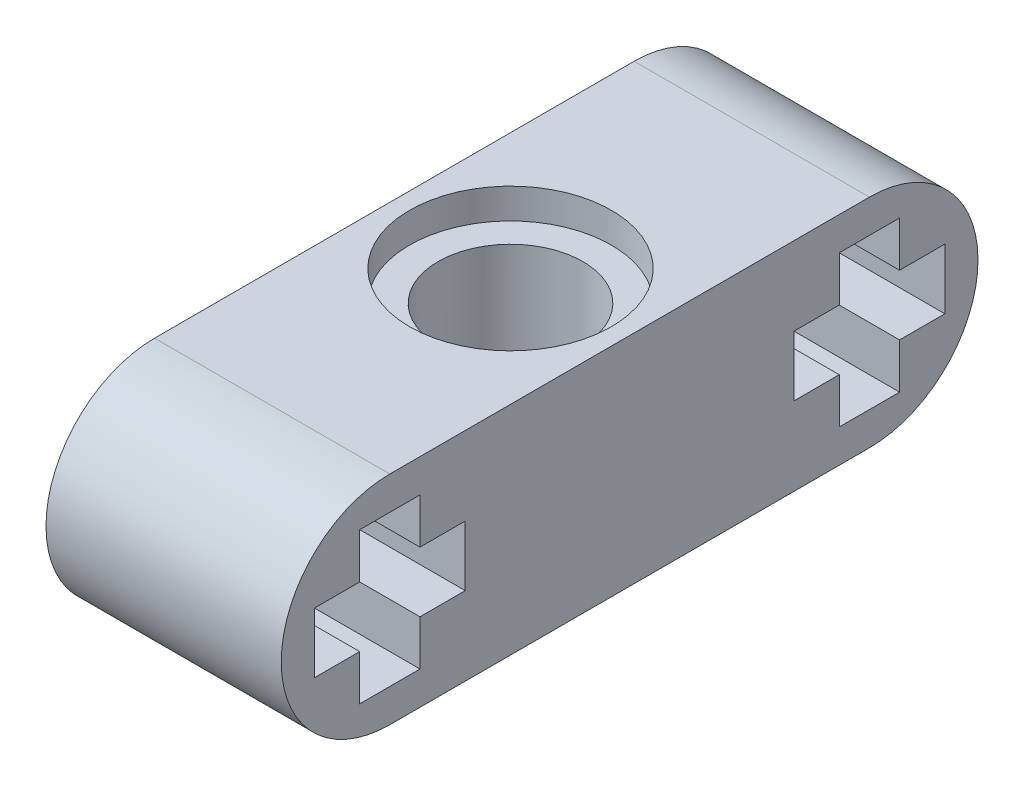
ISO-10303-21;
HEADER;
FILE_DESCRIPTION(('STEP AP214'),'2;1');
FILE_NAME('part.step','',(''),(''),'','','');
FILE_SCHEMA(('AUTOMOTIVE_DESIGN { 1 0 10303 214 1 1 1 1 }'));
ENDSEC;
DATA;
#1=APPLICATION_CONTEXT('core data for automotive mechanical design processes');
#2=APPLICATION_PROTOCOL_DEFINITION('international standard','automotive_design',2000,#1);
#3=PRODUCT_CONTEXT('',#1,'mechanical');
#4=PRODUCT('Part','Part','',(#3));
#5=PRODUCT_RELATED_PRODUCT_CATEGORY('part','',(#4));
#6=PRODUCT_DEFINITION_FORMATION('','',#4);
#7=PRODUCT_DEFINITION_CONTEXT('part definition',#1,'design');
#8=PRODUCT_DEFINITION('design','',#6,#7);
#9=PRODUCT_DEFINITION_SHAPE('','',#8);
#10=(LENGTH_UNIT() NAMED_UNIT(*) SI_UNIT(.MILLI.,.METRE.));
#11=(NAMED_UNIT(*) PLANE_ANGLE_UNIT() SI_UNIT($,.RADIAN.));
#12=(NAMED_UNIT(*) SI_UNIT($,.STERADIAN.) SOLID_ANGLE_UNIT());
#13=UNCERTAINTY_MEASURE_WITH_UNIT(LENGTH_MEASURE(1.E-05),#10,'distance_accuracy_value','');
#14=(GEOMETRIC_REPRESENTATION_CONTEXT(3) GLOBAL_UNCERTAINTY_ASSIGNED_CONTEXT((#13)) GLOBAL_UNIT_ASSIGNED_CONTEXT((#10,
#11,#12)) REPRESENTATION_CONTEXT('',''));
#15=CARTESIAN_POINT('',(0.,0.,0.));
#16=DIRECTION('',(0.,0.,1.));
#17=DIRECTION('',(1.,0.,0.));
#18=AXIS2_PLACEMENT_3D('',#15,#16,#17);
#19=CARTESIAN_POINT('',(3.90000000000001,-3.6,8.00000000000018));
#20=DIRECTION('',(0.,1.,0.));
#21=DIRECTION('',(0.,0.,1.));
#22=AXIS2_PLACEMENT_3D('',#19,#20,#21);
#23=CYLINDRICAL_SURFACE('',#22,2.4);
#24=CARTESIAN_POINT('',(3.90000000000001,2.6,8.00000000000018));
#25=DIRECTION('',(0.,1.,0.));
#26=DIRECTION('',(0.,0.,1.));
#27=AXIS2_PLACEMENT_3D('',#24,#25,#26);
#28=CIRCLE('',#27,2.4);
#29=CARTESIAN_POINT('',(3.90000000000001,2.6,10.4000000000002));
#30=VERTEX_POINT('',#29);
#31=EDGE_CURVE('E278',#30,#30,#28,.F.);
#32=ORIENTED_EDGE('',*,*,#31,.F.);
#33=EDGE_LOOP('',(#32));
#34=FACE_BOUND('',#33,.T.);
#35=CARTESIAN_POINT('',(3.90000000000001,-2.6,8.00000000000018));
#36=DIRECTION('',(0.,-1.,0.));
#37=DIRECTION('',(0.,0.,-1.));
#38=AXIS2_PLACEMENT_3D('',#35,#36,#37);
#39=CIRCLE('',#38,2.4);
#40=CARTESIAN_POINT('',(3.90000000000001,-2.6,5.60000000000018));
#41=VERTEX_POINT('',#40);
#42=EDGE_CURVE('E49',#41,#41,#39,.F.);
#43=ORIENTED_EDGE('',*,*,#42,.F.);
#44=EDGE_LOOP('',(#43));
#45=FACE_BOUND('',#44,.T.);
#46=ADVANCED_FACE('F45',(#34,#45),#23,.F.);
#47=CARTESIAN_POINT('',(7.8,0.,0.));
#48=DIRECTION('',(1.,0.,0.));
#49=DIRECTION('',(0.,0.,-1.));
#50=AXIS2_PLACEMENT_3D('',#47,#48,#49);
#51=PLANE('',#50);
#52=CARTESIAN_POINT('',(7.8,0.,0.));
#53=DIRECTION('',(1.,0.,0.));
#54=DIRECTION('',(0.,0.,-1.));
#55=AXIS2_PLACEMENT_3D('',#52,#53,#54);
#56=CIRCLE('',#55,3.6);
#57=CARTESIAN_POINT('',(7.8,-3.6,0.));
#58=VERTEX_POINT('',#57);
#59=CARTESIAN_POINT('',(7.8,3.6,0.));
#60=VERTEX_POINT('',#59);
#61=EDGE_CURVE('E415',#58,#60,#56,.T.);
#62=ORIENTED_EDGE('',*,*,#61,.T.);
#63=DIRECTION('',(0.,0.,1.));
#64=VECTOR('',#63,1.);
#65=CARTESIAN_POINT('',(7.8,3.6,0.));
#66=LINE('',#65,#64);
#67=CARTESIAN_POINT('',(7.8,3.6,15.8999999999966));
#68=VERTEX_POINT('',#67);
#69=EDGE_CURVE('E418',#60,#68,#66,.T.);
#70=ORIENTED_EDGE('',*,*,#69,.T.);
#71=CARTESIAN_POINT('',(7.8,0.,15.8999999999966));
#72=DIRECTION('',(1.,0.,0.));
#73=DIRECTION('',(0.,0.,-1.));
#74=AXIS2_PLACEMENT_3D('',#71,#72,#73);
#75=CIRCLE('',#74,3.6);
#76=CARTESIAN_POINT('',(7.8,-3.6,15.8999999999966));
#77=VERTEX_POINT('',#76);
#78=EDGE_CURVE('E421',#68,#77,#75,.T.);
#79=ORIENTED_EDGE('',*,*,#78,.T.);
#80=DIRECTION('',(0.,0.,-1.));
#81=VECTOR('',#80,1.);
#82=CARTESIAN_POINT('',(7.8,-3.6,0.));
#83=LINE('',#82,#81);
#84=EDGE_CURVE('E423',#77,#58,#83,.T.);
#85=ORIENTED_EDGE('',*,*,#84,.T.);
#86=EDGE_LOOP('',(#62,#70,#79,#85));
#87=FACE_BOUND('',#86,.T.);
#88=DIRECTION('',(0.,1.,0.));
#89=VECTOR('',#88,1.);
#90=CARTESIAN_POINT('',(7.8,1.,-1.));
#91=LINE('',#90,#89);
#92=CARTESIAN_POINT('',(7.8,1.,-1.));
#93=VERTEX_POINT('',#92);
#94=CARTESIAN_POINT('',(7.8,2.5,-1.));
#95=VERTEX_POINT('',#94);
#96=EDGE_CURVE('E330',#93,#95,#91,.T.);
#97=ORIENTED_EDGE('',*,*,#96,.F.);
#98=DIRECTION('',(0.,0.,1.));
#99=VECTOR('',#98,1.);
#100=CARTESIAN_POINT('',(7.8,1.,-1.));
#101=LINE('',#100,#99);
#102=CARTESIAN_POINT('',(7.8,1.,-2.5));
#103=VERTEX_POINT('',#102);
#104=EDGE_CURVE('E328',#103,#93,#101,.T.);
#105=ORIENTED_EDGE('',*,*,#104,.F.);
#106=DIRECTION('',(0.,1.,0.));
#107=VECTOR('',#106,1.);
#108=CARTESIAN_POINT('',(7.8,-1.,-2.5));
#109=LINE('',#108,#107);
#110=CARTESIAN_POINT('',(7.8,-1.,-2.5));
#111=VERTEX_POINT('',#110);
#112=EDGE_CURVE('E352',#111,#103,#109,.T.);
#113=ORIENTED_EDGE('',*,*,#112,.F.);
#114=DIRECTION('',(0.,0.,-1.));
#115=VECTOR('',#114,1.);
#116=CARTESIAN_POINT('',(7.8,-1.,-1.));
#117=LINE('',#116,#115);
#118=CARTESIAN_POINT('',(7.8,-1.,-1.));
#119=VERTEX_POINT('',#118);
#120=EDGE_CURVE('E349',#119,#111,#117,.T.);
#121=ORIENTED_EDGE('',*,*,#120,.F.);
#122=DIRECTION('',(0.,1.,0.));
#123=VECTOR('',#122,1.);
#124=CARTESIAN_POINT('',(7.8,-2.5,-1.));
#125=LINE('',#124,#123);
#126=CARTESIAN_POINT('',(7.8,-2.5,-1.));
#127=VERTEX_POINT('',#126);
#128=EDGE_CURVE('E347',#127,#119,#125,.T.);
#129=ORIENTED_EDGE('',*,*,#128,.F.);
#130=DIRECTION('',(0.,0.,-1.));
#131=VECTOR('',#130,1.);
#132=CARTESIAN_POINT('',(7.8,-2.5,-1.));
#133=LINE('',#132,#131);
#134=CARTESIAN_POINT('',(7.8,-2.5,1.));
#135=VERTEX_POINT('',#134);
#136=EDGE_CURVE('E345',#135,#127,#133,.T.);
#137=ORIENTED_EDGE('',*,*,#136,.F.);
#138=DIRECTION('',(0.,-1.,0.));
#139=VECTOR('',#138,1.);
#140=CARTESIAN_POINT('',(7.8,-2.5,1.));
#141=LINE('',#140,#139);
#142=CARTESIAN_POINT('',(7.8,-1.,1.));
#143=VERTEX_POINT('',#142);
#144=EDGE_CURVE('E343',#143,#135,#141,.T.);
#145=ORIENTED_EDGE('',*,*,#144,.F.);
#146=DIRECTION('',(0.,0.,-1.));
#147=VECTOR('',#146,1.);
#148=CARTESIAN_POINT('',(7.8,-1.,2.5));
#149=LINE('',#148,#147);
#150=CARTESIAN_POINT('',(7.8,-1.,2.5));
#151=VERTEX_POINT('',#150);
#152=EDGE_CURVE('E341',#151,#143,#149,.T.);
#153=ORIENTED_EDGE('',*,*,#152,.F.);
#154=DIRECTION('',(0.,-1.,0.));
#155=VECTOR('',#154,1.);
#156=CARTESIAN_POINT('',(7.8,-1.,2.5));
#157=LINE('',#156,#155);
#158=CARTESIAN_POINT('',(7.8,1.,2.5));
#159=VERTEX_POINT('',#158);
#160=EDGE_CURVE('E339',#159,#151,#157,.T.);
#161=ORIENTED_EDGE('',*,*,#160,.F.);
#162=DIRECTION('',(0.,0.,1.));
#163=VECTOR('',#162,1.);
#164=CARTESIAN_POINT('',(7.8,1.,2.5));
#165=LINE('',#164,#163);
#166=CARTESIAN_POINT('',(7.8,1.,1.));
#167=VERTEX_POINT('',#166);
#168=EDGE_CURVE('E337',#167,#159,#165,.T.);
#169=ORIENTED_EDGE('',*,*,#168,.F.);
#170=DIRECTION('',(0.,-1.,0.));
#171=VECTOR('',#170,1.);
#172=CARTESIAN_POINT('',(7.8,1.,1.));
#173=LINE('',#172,#171);
#174=CARTESIAN_POINT('',(7.8,2.5,1.));
#175=VERTEX_POINT('',#174);
#176=EDGE_CURVE('E335',#175,#167,#173,.T.);
#177=ORIENTED_EDGE('',*,*,#176,.F.);
#178=DIRECTION('',(0.,0.,1.));
#179=VECTOR('',#178,1.);
#180=CARTESIAN_POINT('',(7.8,2.5,-1.));
#181=LINE('',#180,#179);
#182=EDGE_CURVE('E333',#95,#175,#181,.T.);
#183=ORIENTED_EDGE('',*,*,#182,.F.);
#184=EDGE_LOOP('',(#97,#105,#113,#121,#129,#137,#145,#153,#161,#169,#177,#183));
#185=FACE_BOUND('',#184,.T.);
#186=DIRECTION('',(0.,1.,0.));
#187=VECTOR('',#186,1.);
#188=CARTESIAN_POINT('',(7.8,-1.,13.3999999999931));
#189=LINE('',#188,#187);
#190=CARTESIAN_POINT('',(7.8,-1.,13.3999999999931));
#191=VERTEX_POINT('',#190);
#192=CARTESIAN_POINT('',(7.8,1.,13.3999999999931));
#193=VERTEX_POINT('',#192);
#194=EDGE_CURVE('E240',#191,#193,#189,.T.);
#195=ORIENTED_EDGE('',*,*,#194,.F.);
#196=DIRECTION('',(0.,0.,-1.));
#197=VECTOR('',#196,1.);
#198=CARTESIAN_POINT('',(7.8,-1.,13.3999999999931));
#199=LINE('',#198,#197);
#200=CARTESIAN_POINT('',(7.8,-1.,14.8999999999931));
#201=VERTEX_POINT('',#200);
#202=EDGE_CURVE('E232',#201,#191,#199,.T.);
#203=ORIENTED_EDGE('',*,*,#202,.F.);
#204=DIRECTION('',(0.,1.,0.));
#205=VECTOR('',#204,1.);
#206=CARTESIAN_POINT('',(7.8,-2.5,14.8999999999931));
#207=LINE('',#206,#205);
#208=CARTESIAN_POINT('',(7.8,-2.5,14.8999999999931));
#209=VERTEX_POINT('',#208);
#210=EDGE_CURVE('E275',#209,#201,#207,.T.);
#211=ORIENTED_EDGE('',*,*,#210,.F.);
#212=DIRECTION('',(0.,0.,-1.));
#213=VECTOR('',#212,1.);
#214=CARTESIAN_POINT('',(7.8,-2.5,16.8999999999931));
#215=LINE('',#214,#213);
#216=CARTESIAN_POINT('',(7.8,-2.5,16.8999999999931));
#217=VERTEX_POINT('',#216);
#218=EDGE_CURVE('E273',#217,#209,#215,.T.);
#219=ORIENTED_EDGE('',*,*,#218,.F.);
#220=DIRECTION('',(0.,-1.,0.));
#221=VECTOR('',#220,1.);
#222=CARTESIAN_POINT('',(7.8,-2.5,16.8999999999931));
#223=LINE('',#222,#221);
#224=CARTESIAN_POINT('',(7.8,-1.,16.8999999999931));
#225=VERTEX_POINT('',#224);
#226=EDGE_CURVE('E271',#225,#217,#223,.T.);
#227=ORIENTED_EDGE('',*,*,#226,.F.);
#228=DIRECTION('',(0.,0.,-1.));
#229=VECTOR('',#228,1.);
#230=CARTESIAN_POINT('',(7.8,-1.,16.8999999999931));
#231=LINE('',#230,#229);
#232=CARTESIAN_POINT('',(7.8,-1.,18.3999999999931));
#233=VERTEX_POINT('',#232);
#234=EDGE_CURVE('E269',#233,#225,#231,.T.);
#235=ORIENTED_EDGE('',*,*,#234,.F.);
#236=DIRECTION('',(0.,-1.,0.));
#237=VECTOR('',#236,1.);
#238=CARTESIAN_POINT('',(7.8,-1.,18.3999999999931));
#239=LINE('',#238,#237);
#240=CARTESIAN_POINT('',(7.8,1.,18.3999999999931));
#241=VERTEX_POINT('',#240);
#242=EDGE_CURVE('E267',#241,#233,#239,.T.);
#243=ORIENTED_EDGE('',*,*,#242,.F.);
#244=DIRECTION('',(0.,0.,1.));
#245=VECTOR('',#244,1.);
#246=CARTESIAN_POINT('',(7.8,1.,16.8999999999931));
#247=LINE('',#246,#245);
#248=CARTESIAN_POINT('',(7.8,1.,16.8999999999931));
#249=VERTEX_POINT('',#248);
#250=EDGE_CURVE('E265',#249,#241,#247,.T.);
#251=ORIENTED_EDGE('',*,*,#250,.F.);
#252=DIRECTION('',(0.,-1.,0.));
#253=VECTOR('',#252,1.);
#254=CARTESIAN_POINT('',(7.8,1.,16.8999999999931));
#255=LINE('',#254,#253);
#256=CARTESIAN_POINT('',(7.8,2.5,16.8999999999931));
#257=VERTEX_POINT('',#256);
#258=EDGE_CURVE('E263',#257,#249,#255,.T.);
#259=ORIENTED_EDGE('',*,*,#258,.F.);
#260=DIRECTION('',(0.,0.,1.));
#261=VECTOR('',#260,1.);
#262=CARTESIAN_POINT('',(7.8,2.5,16.8999999999931));
#263=LINE('',#262,#261);
#264=CARTESIAN_POINT('',(7.8,2.5,14.8999999999931));
#265=VERTEX_POINT('',#264);
#266=EDGE_CURVE('E261',#265,#257,#263,.T.);
#267=ORIENTED_EDGE('',*,*,#266,.F.);
#268=DIRECTION('',(0.,1.,0.));
#269=VECTOR('',#268,1.);
#270=CARTESIAN_POINT('',(7.8,1.,14.8999999999931));
#271=LINE('',#270,#269);
#272=CARTESIAN_POINT('',(7.8,1.,14.8999999999931));
#273=VERTEX_POINT('',#272);
#274=EDGE_CURVE('E256',#273,#265,#271,.T.);
#275=ORIENTED_EDGE('',*,*,#274,.F.);
#276=DIRECTION('',(0.,0.,1.));
#277=VECTOR('',#276,1.);
#278=CARTESIAN_POINT('',(7.8,1.,13.3999999999931));
#279=LINE('',#278,#277);
#280=EDGE_CURVE('E254',#193,#273,#279,.T.);
#281=ORIENTED_EDGE('',*,*,#280,.F.);
#282=EDGE_LOOP('',(#195,#203,#211,#219,#227,#235,#243,#251,#259,#267,#275,#281));
#283=FACE_BOUND('',#282,.T.);
#284=ADVANCED_FACE('F252',(#87,#185,#283),#51,.T.);
#285=CARTESIAN_POINT('',(0.,0.,0.));
#286=DIRECTION('',(1.,0.,0.));
#287=DIRECTION('',(0.,0.,-1.));
#288=AXIS2_PLACEMENT_3D('',#285,#286,#287);
#289=PLANE('',#288);
#290=DIRECTION('',(0.,0.,1.));
#291=VECTOR('',#290,1.);
#292=CARTESIAN_POINT('',(0.,1.,-1.));
#293=LINE('',#292,#291);
#294=CARTESIAN_POINT('',(0.,1.,-2.5));
#295=VERTEX_POINT('',#294);
#296=CARTESIAN_POINT('',(0.,1.,-1.));
#297=VERTEX_POINT('',#296);
#298=EDGE_CURVE('E248',#295,#297,#293,.T.);
#299=ORIENTED_EDGE('',*,*,#298,.T.);
#300=DIRECTION('',(0.,1.,0.));
#301=VECTOR('',#300,1.);
#302=CARTESIAN_POINT('',(0.,1.,-1.));
#303=LINE('',#302,#301);
#304=CARTESIAN_POINT('',(0.,2.5,-1.));
#305=VERTEX_POINT('',#304);
#306=EDGE_CURVE('E357',#297,#305,#303,.T.);
#307=ORIENTED_EDGE('',*,*,#306,.T.);
#308=DIRECTION('',(0.,0.,1.));
#309=VECTOR('',#308,1.);
#310=CARTESIAN_POINT('',(0.,2.5,-1.));
#311=LINE('',#310,#309);
#312=CARTESIAN_POINT('',(0.,2.5,1.));
#313=VERTEX_POINT('',#312);
#314=EDGE_CURVE('E360',#305,#313,#311,.T.);
#315=ORIENTED_EDGE('',*,*,#314,.T.);
#316=DIRECTION('',(0.,-1.,0.));
#317=VECTOR('',#316,1.);
#318=CARTESIAN_POINT('',(0.,1.,1.));
#319=LINE('',#318,#317);
#320=CARTESIAN_POINT('',(0.,1.,1.));
#321=VERTEX_POINT('',#320);
#322=EDGE_CURVE('E363',#313,#321,#319,.T.);
#323=ORIENTED_EDGE('',*,*,#322,.T.);
#324=DIRECTION('',(0.,0.,1.));
#325=VECTOR('',#324,1.);
#326=CARTESIAN_POINT('',(0.,1.,2.5));
#327=LINE('',#326,#325);
#328=CARTESIAN_POINT('',(0.,1.,2.5));
#329=VERTEX_POINT('',#328);
#330=EDGE_CURVE('E366',#321,#329,#327,.T.);
#331=ORIENTED_EDGE('',*,*,#330,.T.);
#332=DIRECTION('',(0.,-1.,0.));
#333=VECTOR('',#332,1.);
#334=CARTESIAN_POINT('',(0.,-1.,2.5));
#335=LINE('',#334,#333);
#336=CARTESIAN_POINT('',(0.,-1.,2.5));
#337=VERTEX_POINT('',#336);
#338=EDGE_CURVE('E369',#329,#337,#335,.T.);
#339=ORIENTED_EDGE('',*,*,#338,.T.);
#340=DIRECTION('',(0.,0.,-1.));
#341=VECTOR('',#340,1.);
#342=CARTESIAN_POINT('',(0.,-1.,2.5));
#343=LINE('',#342,#341);
#344=CARTESIAN_POINT('',(0.,-1.,1.));
#345=VERTEX_POINT('',#344);
#346=EDGE_CURVE('E372',#337,#345,#343,.T.);
#347=ORIENTED_EDGE('',*,*,#346,.T.);
#348=DIRECTION('',(0.,-1.,0.));
#349=VECTOR('',#348,1.);
#350=CARTESIAN_POINT('',(0.,-2.5,1.));
#351=LINE('',#350,#349);
#352=CARTESIAN_POINT('',(0.,-2.5,1.));
#353=VERTEX_POINT('',#352);
#354=EDGE_CURVE('E375',#345,#353,#351,.T.);
#355=ORIENTED_EDGE('',*,*,#354,.T.);
#356=DIRECTION('',(0.,0.,-1.));
#357=VECTOR('',#356,1.);
#358=CARTESIAN_POINT('',(0.,-2.5,-1.));
#359=LINE('',#358,#357);
#360=CARTESIAN_POINT('',(0.,-2.5,-1.));
#361=VERTEX_POINT('',#360);
#362=EDGE_CURVE('E378',#353,#361,#359,.T.);
#363=ORIENTED_EDGE('',*,*,#362,.T.);
#364=DIRECTION('',(0.,1.,0.));
#365=VECTOR('',#364,1.);
#366=CARTESIAN_POINT('',(0.,-2.5,-1.));
#367=LINE('',#366,#365);
#368=CARTESIAN_POINT('',(0.,-1.,-1.));
#369=VERTEX_POINT('',#368);
#370=EDGE_CURVE('E381',#361,#369,#367,.T.);
#371=ORIENTED_EDGE('',*,*,#370,.T.);
#372=DIRECTION('',(0.,0.,-1.));
#373=VECTOR('',#372,1.);
#374=CARTESIAN_POINT('',(0.,-1.,-1.));
#375=LINE('',#374,#373);
#376=CARTESIAN_POINT('',(0.,-1.,-2.5));
#377=VERTEX_POINT('',#376);
#378=EDGE_CURVE('E384',#369,#377,#375,.T.);
#379=ORIENTED_EDGE('',*,*,#378,.T.);
#380=DIRECTION('',(0.,1.,0.));
#381=VECTOR('',#380,1.);
#382=CARTESIAN_POINT('',(0.,-1.,-2.5));
#383=LINE('',#382,#381);
#384=EDGE_CURVE('E331',#377,#295,#383,.T.);
#385=ORIENTED_EDGE('',*,*,#384,.T.);
#386=EDGE_LOOP('',(#299,#307,#315,#323,#331,#339,#347,#355,#363,#371,#379,#385));
#387=FACE_BOUND('',#386,.T.);
#388=CARTESIAN_POINT('',(0.,0.,0.));
#389=DIRECTION('',(1.,0.,0.));
#390=DIRECTION('',(0.,0.,-1.));
#391=AXIS2_PLACEMENT_3D('',#388,#389,#390);
#392=CIRCLE('',#391,3.6);
#393=CARTESIAN_POINT('',(0.,-3.6,0.));
#394=VERTEX_POINT('',#393);
#395=CARTESIAN_POINT('',(0.,3.6,0.));
#396=VERTEX_POINT('',#395);
#397=EDGE_CURVE('E414',#394,#396,#392,.T.);
#398=ORIENTED_EDGE('',*,*,#397,.F.);
#399=DIRECTION('',(0.,0.,-1.));
#400=VECTOR('',#399,1.);
#401=CARTESIAN_POINT('',(0.,-3.6,0.));
#402=LINE('',#401,#400);
#403=CARTESIAN_POINT('',(0.,-3.6,15.8999999999966));
#404=VERTEX_POINT('',#403);
#405=EDGE_CURVE('E419',#404,#394,#402,.T.);
#406=ORIENTED_EDGE('',*,*,#405,.F.);
#407=CARTESIAN_POINT('',(0.,0.,15.8999999999966));
#408=DIRECTION('',(1.,0.,0.));
#409=DIRECTION('',(0.,0.,-1.));
#410=AXIS2_PLACEMENT_3D('',#407,#408,#409);
#411=CIRCLE('',#410,3.6);
#412=CARTESIAN_POINT('',(0.,3.6,15.8999999999966));
#413=VERTEX_POINT('',#412);
#414=EDGE_CURVE('E430',#413,#404,#411,.T.);
#415=ORIENTED_EDGE('',*,*,#414,.F.);
#416=DIRECTION('',(0.,0.,1.));
#417=VECTOR('',#416,1.);
#418=CARTESIAN_POINT('',(0.,3.6,0.));
#419=LINE('',#418,#417);
#420=EDGE_CURVE('E428',#396,#413,#419,.T.);
#421=ORIENTED_EDGE('',*,*,#420,.F.);
#422=EDGE_LOOP('',(#398,#406,#415,#421));
#423=FACE_BOUND('',#422,.T.);
#424=DIRECTION('',(0.,0.,-1.));
#425=VECTOR('',#424,1.);
#426=CARTESIAN_POINT('',(0.,-1.,13.3999999999931));
#427=LINE('',#426,#425);
#428=CARTESIAN_POINT('',(0.,-1.,14.8999999999931));
#429=VERTEX_POINT('',#428);
#430=CARTESIAN_POINT('',(0.,-1.,13.3999999999931));
#431=VERTEX_POINT('',#430);
#432=EDGE_CURVE('E70',#429,#431,#427,.T.);
#433=ORIENTED_EDGE('',*,*,#432,.T.);
#434=DIRECTION('',(0.,1.,0.));
#435=VECTOR('',#434,1.);
#436=CARTESIAN_POINT('',(0.,-1.,13.3999999999931));
#437=LINE('',#436,#435);
#438=CARTESIAN_POINT('',(0.,1.,13.3999999999931));
#439=VERTEX_POINT('',#438);
#440=EDGE_CURVE('E247',#431,#439,#437,.T.);
#441=ORIENTED_EDGE('',*,*,#440,.T.);
#442=DIRECTION('',(0.,0.,1.));
#443=VECTOR('',#442,1.);
#444=CARTESIAN_POINT('',(0.,1.,13.3999999999931));
#445=LINE('',#444,#443);
#446=CARTESIAN_POINT('',(0.,1.,14.8999999999931));
#447=VERTEX_POINT('',#446);
#448=EDGE_CURVE('E280',#439,#447,#445,.T.);
#449=ORIENTED_EDGE('',*,*,#448,.T.);
#450=DIRECTION('',(0.,1.,0.));
#451=VECTOR('',#450,1.);
#452=CARTESIAN_POINT('',(0.,1.,14.8999999999931));
#453=LINE('',#452,#451);
#454=CARTESIAN_POINT('',(0.,2.5,14.8999999999931));
#455=VERTEX_POINT('',#454);
#456=EDGE_CURVE('E283',#447,#455,#453,.T.);
#457=ORIENTED_EDGE('',*,*,#456,.T.);
#458=DIRECTION('',(0.,0.,1.));
#459=VECTOR('',#458,1.);
#460=CARTESIAN_POINT('',(0.,2.5,16.8999999999931));
#461=LINE('',#460,#459);
#462=CARTESIAN_POINT('',(0.,2.5,16.8999999999931));
#463=VERTEX_POINT('',#462);
#464=EDGE_CURVE('E286',#455,#463,#461,.T.);
#465=ORIENTED_EDGE('',*,*,#464,.T.);
#466=DIRECTION('',(0.,-1.,0.));
#467=VECTOR('',#466,1.);
#468=CARTESIAN_POINT('',(0.,1.,16.8999999999931));
#469=LINE('',#468,#467);
#470=CARTESIAN_POINT('',(0.,1.,16.8999999999931));
#471=VERTEX_POINT('',#470);
#472=EDGE_CURVE('E289',#463,#471,#469,.T.);
#473=ORIENTED_EDGE('',*,*,#472,.T.);
#474=DIRECTION('',(0.,0.,1.));
#475=VECTOR('',#474,1.);
#476=CARTESIAN_POINT('',(0.,1.,16.8999999999931));
#477=LINE('',#476,#475);
#478=CARTESIAN_POINT('',(0.,1.,18.3999999999931));
#479=VERTEX_POINT('',#478);
#480=EDGE_CURVE('E292',#471,#479,#477,.T.);
#481=ORIENTED_EDGE('',*,*,#480,.T.);
#482=DIRECTION('',(0.,-1.,0.));
#483=VECTOR('',#482,1.);
#484=CARTESIAN_POINT('',(0.,-1.,18.3999999999931));
#485=LINE('',#484,#483);
#486=CARTESIAN_POINT('',(0.,-1.,18.3999999999931));
#487=VERTEX_POINT('',#486);
#488=EDGE_CURVE('E295',#479,#487,#485,.T.);
#489=ORIENTED_EDGE('',*,*,#488,.T.);
#490=DIRECTION('',(0.,0.,-1.));
#491=VECTOR('',#490,1.);
#492=CARTESIAN_POINT('',(0.,-1.,16.8999999999931));
#493=LINE('',#492,#491);
#494=CARTESIAN_POINT('',(0.,-1.,16.8999999999931));
#495=VERTEX_POINT('',#494);
#496=EDGE_CURVE('E298',#487,#495,#493,.T.);
#497=ORIENTED_EDGE('',*,*,#496,.T.);
#498=DIRECTION('',(0.,-1.,0.));
#499=VECTOR('',#498,1.);
#500=CARTESIAN_POINT('',(0.,-2.5,16.8999999999931));
#501=LINE('',#500,#499);
#502=CARTESIAN_POINT('',(0.,-2.5,16.8999999999931));
#503=VERTEX_POINT('',#502);
#504=EDGE_CURVE('E301',#495,#503,#501,.T.);
#505=ORIENTED_EDGE('',*,*,#504,.T.);
#506=DIRECTION('',(0.,0.,-1.));
#507=VECTOR('',#506,1.);
#508=CARTESIAN_POINT('',(0.,-2.5,16.8999999999931));
#509=LINE('',#508,#507);
#510=CARTESIAN_POINT('',(0.,-2.5,14.8999999999931));
#511=VERTEX_POINT('',#510);
#512=EDGE_CURVE('E304',#503,#511,#509,.T.);
#513=ORIENTED_EDGE('',*,*,#512,.T.);
#514=DIRECTION('',(0.,1.,0.));
#515=VECTOR('',#514,1.);
#516=CARTESIAN_POINT('',(0.,-2.5,14.8999999999931));
#517=LINE('',#516,#515);
#518=EDGE_CURVE('E241',#511,#429,#517,.T.);
#519=ORIENTED_EDGE('',*,*,#518,.T.);
#520=EDGE_LOOP('',(#433,#441,#449,#457,#465,#473,#481,#489,#497,#505,#513,#519));
#521=FACE_BOUND('',#520,.T.);
#522=ADVANCED_FACE('F468',(#387,#423,#521),#289,.F.);
#523=CARTESIAN_POINT('',(7.8,0.,0.));
#524=DIRECTION('',(-1.,0.,0.));
#525=DIRECTION('',(0.,0.,1.));
#526=AXIS2_PLACEMENT_3D('',#523,#524,#525);
#527=CYLINDRICAL_SURFACE('',#526,3.6);
#528=ORIENTED_EDGE('',*,*,#397,.T.);
#529=DIRECTION('',(-1.,0.,0.));
#530=VECTOR('',#529,1.);
#531=CARTESIAN_POINT('',(7.8,3.6,0.));
#532=LINE('',#531,#530);
#533=EDGE_CURVE('E12',#60,#396,#532,.T.);
#534=ORIENTED_EDGE('',*,*,#533,.F.);
#535=ORIENTED_EDGE('',*,*,#61,.F.);
#536=DIRECTION('',(-1.,0.,0.));
#537=VECTOR('',#536,1.);
#538=CARTESIAN_POINT('',(7.8,-3.6,0.));
#539=LINE('',#538,#537);
#540=EDGE_CURVE('E425',#58,#394,#539,.T.);
#541=ORIENTED_EDGE('',*,*,#540,.T.);
#542=EDGE_LOOP('',(#528,#534,#535,#541));
#543=FACE_BOUND('',#542,.T.);
#544=ADVANCED_FACE('F47',(#543),#527,.T.);
#545=CARTESIAN_POINT('',(7.8,3.6,0.));
#546=DIRECTION('',(0.,-1.,0.));
#547=DIRECTION('',(0.,0.,-1.));
#548=AXIS2_PLACEMENT_3D('',#545,#546,#547);
#549=PLANE('',#548);
#550=CARTESIAN_POINT('',(3.90000000000001,3.6,8.00000000000018));
#551=DIRECTION('',(0.,1.,0.));
#552=DIRECTION('',(0.,0.,1.));
#553=AXIS2_PLACEMENT_3D('',#550,#551,#552);
#554=CIRCLE('',#553,3.34538230195665);
#555=CARTESIAN_POINT('',(3.90000000000001,3.6,11.3453823019568));
#556=VERTEX_POINT('',#555);
#557=EDGE_CURVE('E444',#556,#556,#554,.T.);
#558=ORIENTED_EDGE('',*,*,#557,.F.);
#559=EDGE_LOOP('',(#558));
#560=FACE_BOUND('',#559,.T.);
#561=ORIENTED_EDGE('',*,*,#420,.T.);
#562=DIRECTION('',(-1.,0.,0.));
#563=VECTOR('',#562,1.);
#564=CARTESIAN_POINT('',(7.8,3.6,15.8999999999966));
#565=LINE('',#564,#563);
#566=EDGE_CURVE('E54',#68,#413,#565,.T.);
#567=ORIENTED_EDGE('',*,*,#566,.F.);
#568=ORIENTED_EDGE('',*,*,#69,.F.);
#569=ORIENTED_EDGE('',*,*,#533,.T.);
#570=EDGE_LOOP('',(#561,#567,#568,#569));
#571=FACE_BOUND('',#570,.T.);
#572=ADVANCED_FACE('F576',(#560,#571),#549,.F.);
#573=CARTESIAN_POINT('',(7.8,0.,15.8999999999966));
#574=DIRECTION('',(-1.,0.,0.));
#575=DIRECTION('',(0.,0.,1.));
#576=AXIS2_PLACEMENT_3D('',#573,#574,#575);
#577=CYLINDRICAL_SURFACE('',#576,3.6);
#578=ORIENTED_EDGE('',*,*,#414,.T.);
#579=DIRECTION('',(-1.,0.,0.));
#580=VECTOR('',#579,1.);
#581=CARTESIAN_POINT('',(7.8,-3.6,15.8999999999966));
#582=LINE('',#581,#580);
#583=EDGE_CURVE('E435',#77,#404,#582,.T.);
#584=ORIENTED_EDGE('',*,*,#583,.F.);
#585=ORIENTED_EDGE('',*,*,#78,.F.);
#586=ORIENTED_EDGE('',*,*,#566,.T.);
#587=EDGE_LOOP('',(#578,#584,#585,#586));
#588=FACE_BOUND('',#587,.T.);
#589=ADVANCED_FACE('F573',(#588),#577,.T.);
#590=CARTESIAN_POINT('',(7.8,-3.6,0.));
#591=DIRECTION('',(0.,1.,0.));
#592=DIRECTION('',(0.,0.,1.));
#593=AXIS2_PLACEMENT_3D('',#590,#591,#592);
#594=PLANE('',#593);
#595=CARTESIAN_POINT('',(3.90000000000001,-3.6,8.00000000000018));
#596=DIRECTION('',(0.,1.,0.));
#597=DIRECTION('',(0.,0.,1.));
#598=AXIS2_PLACEMENT_3D('',#595,#596,#597);
#599=CIRCLE('',#598,3.34538230195665);
#600=CARTESIAN_POINT('',(3.90000000000001,-3.6,11.3453823019568));
#601=VERTEX_POINT('',#600);
#602=EDGE_CURVE('E450',#601,#601,#599,.T.);
#603=ORIENTED_EDGE('',*,*,#602,.T.);
#604=EDGE_LOOP('',(#603));
#605=FACE_BOUND('',#604,.T.);
#606=ORIENTED_EDGE('',*,*,#405,.T.);
#607=ORIENTED_EDGE('',*,*,#540,.F.);
#608=ORIENTED_EDGE('',*,*,#84,.F.);
#609=ORIENTED_EDGE('',*,*,#583,.T.);
#610=EDGE_LOOP('',(#606,#607,#608,#609));
#611=FACE_BOUND('',#610,.T.);
#612=ADVANCED_FACE('F565',(#605,#611),#594,.F.);
#613=CARTESIAN_POINT('',(7.8,1.,-1.));
#614=DIRECTION('',(0.,-1.,0.));
#615=DIRECTION('',(0.,0.,-1.));
#616=AXIS2_PLACEMENT_3D('',#613,#614,#615);
#617=PLANE('',#616);
#618=ORIENTED_EDGE('',*,*,#298,.F.);
#619=DIRECTION('',(-1.,0.,0.));
#620=VECTOR('',#619,1.);
#621=CARTESIAN_POINT('',(7.8,1.,-2.5));
#622=LINE('',#621,#620);
#623=EDGE_CURVE('E354',#103,#295,#622,.T.);
#624=ORIENTED_EDGE('',*,*,#623,.F.);
#625=ORIENTED_EDGE('',*,*,#104,.T.);
#626=DIRECTION('',(-1.,0.,0.));
#627=VECTOR('',#626,1.);
#628=CARTESIAN_POINT('',(7.8,1.,-1.));
#629=LINE('',#628,#627);
#630=EDGE_CURVE('E411',#93,#297,#629,.T.);
#631=ORIENTED_EDGE('',*,*,#630,.T.);
#632=EDGE_LOOP('',(#618,#624,#625,#631));
#633=FACE_BOUND('',#632,.T.);
#634=ADVANCED_FACE('F562',(#633),#617,.T.);
#635=CARTESIAN_POINT('',(7.8,1.,-1.));
#636=DIRECTION('',(0.,0.,1.));
#637=DIRECTION('',(1.,0.,0.));
#638=AXIS2_PLACEMENT_3D('',#635,#636,#637);
#639=PLANE('',#638);
#640=ORIENTED_EDGE('',*,*,#306,.F.);
#641=ORIENTED_EDGE('',*,*,#630,.F.);
#642=ORIENTED_EDGE('',*,*,#96,.T.);
#643=DIRECTION('',(-1.,0.,0.));
#644=VECTOR('',#643,1.);
#645=CARTESIAN_POINT('',(7.8,2.5,-1.));
#646=LINE('',#645,#644);
#647=EDGE_CURVE('E409',#95,#305,#646,.T.);
#648=ORIENTED_EDGE('',*,*,#647,.T.);
#649=EDGE_LOOP('',(#640,#641,#642,#648));
#650=FACE_BOUND('',#649,.T.);
#651=ADVANCED_FACE('F558',(#650),#639,.T.);
#652=CARTESIAN_POINT('',(7.8,2.5,-1.));
#653=DIRECTION('',(0.,-1.,0.));
#654=DIRECTION('',(0.,0.,-1.));
#655=AXIS2_PLACEMENT_3D('',#652,#653,#654);
#656=PLANE('',#655);
#657=ORIENTED_EDGE('',*,*,#314,.F.);
#658=ORIENTED_EDGE('',*,*,#647,.F.);
#659=ORIENTED_EDGE('',*,*,#182,.T.);
#660=DIRECTION('',(-1.,0.,0.));
#661=VECTOR('',#660,1.);
#662=CARTESIAN_POINT('',(7.8,2.5,1.));
#663=LINE('',#662,#661);
#664=EDGE_CURVE('E407',#175,#313,#663,.T.);
#665=ORIENTED_EDGE('',*,*,#664,.T.);
#666=EDGE_LOOP('',(#657,#658,#659,#665));
#667=FACE_BOUND('',#666,.T.);
#668=ADVANCED_FACE('F554',(#667),#656,.T.);
#669=CARTESIAN_POINT('',(7.8,1.,1.));
#670=DIRECTION('',(0.,0.,-1.));
#671=DIRECTION('',(-1.,0.,0.));
#672=AXIS2_PLACEMENT_3D('',#669,#670,#671);
#673=PLANE('',#672);
#674=ORIENTED_EDGE('',*,*,#322,.F.);
#675=ORIENTED_EDGE('',*,*,#664,.F.);
#676=ORIENTED_EDGE('',*,*,#176,.T.);
#677=DIRECTION('',(-1.,0.,0.));
#678=VECTOR('',#677,1.);
#679=CARTESIAN_POINT('',(7.8,1.,1.));
#680=LINE('',#679,#678);
#681=EDGE_CURVE('E405',#167,#321,#680,.T.);
#682=ORIENTED_EDGE('',*,*,#681,.T.);
#683=EDGE_LOOP('',(#674,#675,#676,#682));
#684=FACE_BOUND('',#683,.T.);
#685=ADVANCED_FACE('F550',(#684),#673,.T.);
#686=CARTESIAN_POINT('',(7.8,1.,2.5));
#687=DIRECTION('',(0.,-1.,0.));
#688=DIRECTION('',(0.,0.,-1.));
#689=AXIS2_PLACEMENT_3D('',#686,#687,#688);
#690=PLANE('',#689);
#691=ORIENTED_EDGE('',*,*,#330,.F.);
#692=ORIENTED_EDGE('',*,*,#681,.F.);
#693=ORIENTED_EDGE('',*,*,#168,.T.);
#694=DIRECTION('',(-1.,0.,0.));
#695=VECTOR('',#694,1.);
#696=CARTESIAN_POINT('',(7.8,1.,2.5));
#697=LINE('',#696,#695);
#698=EDGE_CURVE('E403',#159,#329,#697,.T.);
#699=ORIENTED_EDGE('',*,*,#698,.T.);
#700=EDGE_LOOP('',(#691,#692,#693,#699));
#701=FACE_BOUND('',#700,.T.);
#702=ADVANCED_FACE('F546',(#701),#690,.T.);
#703=CARTESIAN_POINT('',(7.8,-1.,2.5));
#704=DIRECTION('',(0.,0.,-1.));
#705=DIRECTION('',(-1.,0.,0.));
#706=AXIS2_PLACEMENT_3D('',#703,#704,#705);
#707=PLANE('',#706);
#708=ORIENTED_EDGE('',*,*,#338,.F.);
#709=ORIENTED_EDGE('',*,*,#698,.F.);
#710=ORIENTED_EDGE('',*,*,#160,.T.);
#711=DIRECTION('',(-1.,0.,0.));
#712=VECTOR('',#711,1.);
#713=CARTESIAN_POINT('',(7.8,-1.,2.5));
#714=LINE('',#713,#712);
#715=EDGE_CURVE('E401',#151,#337,#714,.T.);
#716=ORIENTED_EDGE('',*,*,#715,.T.);
#717=EDGE_LOOP('',(#708,#709,#710,#716));
#718=FACE_BOUND('',#717,.T.);
#719=ADVANCED_FACE('F542',(#718),#707,.T.);
#720=CARTESIAN_POINT('',(7.8,-1.,2.5));
#721=DIRECTION('',(0.,1.,0.));
#722=DIRECTION('',(0.,0.,1.));
#723=AXIS2_PLACEMENT_3D('',#720,#721,#722);
#724=PLANE('',#723);
#725=ORIENTED_EDGE('',*,*,#346,.F.);
#726=ORIENTED_EDGE('',*,*,#715,.F.);
#727=ORIENTED_EDGE('',*,*,#152,.T.);
#728=DIRECTION('',(-1.,0.,0.));
#729=VECTOR('',#728,1.);
#730=CARTESIAN_POINT('',(7.8,-1.,1.));
#731=LINE('',#730,#729);
#732=EDGE_CURVE('E399',#143,#345,#731,.T.);
#733=ORIENTED_EDGE('',*,*,#732,.T.);
#734=EDGE_LOOP('',(#725,#726,#727,#733));
#735=FACE_BOUND('',#734,.T.);
#736=ADVANCED_FACE('F538',(#735),#724,.T.);
#737=CARTESIAN_POINT('',(7.8,-2.5,1.));
#738=DIRECTION('',(0.,0.,-1.));
#739=DIRECTION('',(-1.,0.,0.));
#740=AXIS2_PLACEMENT_3D('',#737,#738,#739);
#741=PLANE('',#740);
#742=ORIENTED_EDGE('',*,*,#354,.F.);
#743=ORIENTED_EDGE('',*,*,#732,.F.);
#744=ORIENTED_EDGE('',*,*,#144,.T.);
#745=DIRECTION('',(-1.,0.,0.));
#746=VECTOR('',#745,1.);
#747=CARTESIAN_POINT('',(7.8,-2.5,1.));
#748=LINE('',#747,#746);
#749=EDGE_CURVE('E397',#135,#353,#748,.T.);
#750=ORIENTED_EDGE('',*,*,#749,.T.);
#751=EDGE_LOOP('',(#742,#743,#744,#750));
#752=FACE_BOUND('',#751,.T.);
#753=ADVANCED_FACE('F534',(#752),#741,.T.);
#754=CARTESIAN_POINT('',(7.8,-2.5,-1.));
#755=DIRECTION('',(0.,1.,0.));
#756=DIRECTION('',(0.,0.,1.));
#757=AXIS2_PLACEMENT_3D('',#754,#755,#756);
#758=PLANE('',#757);
#759=ORIENTED_EDGE('',*,*,#362,.F.);
#760=ORIENTED_EDGE('',*,*,#749,.F.);
#761=ORIENTED_EDGE('',*,*,#136,.T.);
#762=DIRECTION('',(-1.,0.,0.));
#763=VECTOR('',#762,1.);
#764=CARTESIAN_POINT('',(7.8,-2.5,-1.));
#765=LINE('',#764,#763);
#766=EDGE_CURVE('E395',#127,#361,#765,.T.);
#767=ORIENTED_EDGE('',*,*,#766,.T.);
#768=EDGE_LOOP('',(#759,#760,#761,#767));
#769=FACE_BOUND('',#768,.T.);
#770=ADVANCED_FACE('F530',(#769),#758,.T.);
#771=CARTESIAN_POINT('',(7.8,-2.5,-1.));
#772=DIRECTION('',(0.,0.,1.));
#773=DIRECTION('',(0.,-1.,0.));
#774=AXIS2_PLACEMENT_3D('',#771,#772,#773);
#775=PLANE('',#774);
#776=ORIENTED_EDGE('',*,*,#370,.F.);
#777=ORIENTED_EDGE('',*,*,#766,.F.);
#778=ORIENTED_EDGE('',*,*,#128,.T.);
#779=DIRECTION('',(-1.,0.,0.));
#780=VECTOR('',#779,1.);
#781=CARTESIAN_POINT('',(7.8,-1.,-1.));
#782=LINE('',#781,#780);
#783=EDGE_CURVE('E393',#119,#369,#782,.T.);
#784=ORIENTED_EDGE('',*,*,#783,.T.);
#785=EDGE_LOOP('',(#776,#777,#778,#784));
#786=FACE_BOUND('',#785,.T.);
#787=ADVANCED_FACE('F526',(#786),#775,.T.);
#788=CARTESIAN_POINT('',(7.8,-1.,-1.));
#789=DIRECTION('',(0.,1.,0.));
#790=DIRECTION('',(0.,0.,1.));
#791=AXIS2_PLACEMENT_3D('',#788,#789,#790);
#792=PLANE('',#791);
#793=ORIENTED_EDGE('',*,*,#378,.F.);
#794=ORIENTED_EDGE('',*,*,#783,.F.);
#795=ORIENTED_EDGE('',*,*,#120,.T.);
#796=DIRECTION('',(-1.,0.,0.));
#797=VECTOR('',#796,1.);
#798=CARTESIAN_POINT('',(7.8,-1.,-2.5));
#799=LINE('',#798,#797);
#800=EDGE_CURVE('E391',#111,#377,#799,.T.);
#801=ORIENTED_EDGE('',*,*,#800,.T.);
#802=EDGE_LOOP('',(#793,#794,#795,#801));
#803=FACE_BOUND('',#802,.T.);
#804=ADVANCED_FACE('F522',(#803),#792,.T.);
#805=CARTESIAN_POINT('',(7.8,-1.,-2.5));
#806=DIRECTION('',(0.,0.,1.));
#807=DIRECTION('',(1.,0.,0.));
#808=AXIS2_PLACEMENT_3D('',#805,#806,#807);
#809=PLANE('',#808);
#810=ORIENTED_EDGE('',*,*,#384,.F.);
#811=ORIENTED_EDGE('',*,*,#800,.F.);
#812=ORIENTED_EDGE('',*,*,#112,.T.);
#813=ORIENTED_EDGE('',*,*,#623,.T.);
#814=EDGE_LOOP('',(#810,#811,#812,#813));
#815=FACE_BOUND('',#814,.T.);
#816=ADVANCED_FACE('F519',(#815),#809,.T.);
#817=CARTESIAN_POINT('',(7.8,-1.,13.3999999999931));
#818=DIRECTION('',(0.,1.,0.));
#819=DIRECTION('',(0.,0.,1.));
#820=AXIS2_PLACEMENT_3D('',#817,#818,#819);
#821=PLANE('',#820);
#822=ORIENTED_EDGE('',*,*,#432,.F.);
#823=DIRECTION('',(-1.,0.,0.));
#824=VECTOR('',#823,1.);
#825=CARTESIAN_POINT('',(7.8,-1.,14.8999999999931));
#826=LINE('',#825,#824);
#827=EDGE_CURVE('E236',#201,#429,#826,.T.);
#828=ORIENTED_EDGE('',*,*,#827,.F.);
#829=ORIENTED_EDGE('',*,*,#202,.T.);
#830=DIRECTION('',(-1.,0.,0.));
#831=VECTOR('',#830,1.);
#832=CARTESIAN_POINT('',(7.8,-1.,13.3999999999931));
#833=LINE('',#832,#831);
#834=EDGE_CURVE('E235',#191,#431,#833,.T.);
#835=ORIENTED_EDGE('',*,*,#834,.T.);
#836=EDGE_LOOP('',(#822,#828,#829,#835));
#837=FACE_BOUND('',#836,.T.);
#838=ADVANCED_FACE('F234',(#837),#821,.T.);
#839=CARTESIAN_POINT('',(7.8,-1.,13.3999999999931));
#840=DIRECTION('',(0.,0.,1.));
#841=DIRECTION('',(1.,0.,0.));
#842=AXIS2_PLACEMENT_3D('',#839,#840,#841);
#843=PLANE('',#842);
#844=ORIENTED_EDGE('',*,*,#440,.F.);
#845=ORIENTED_EDGE('',*,*,#834,.F.);
#846=ORIENTED_EDGE('',*,*,#194,.T.);
#847=DIRECTION('',(-1.,0.,0.));
#848=VECTOR('',#847,1.);
#849=CARTESIAN_POINT('',(7.8,1.,13.3999999999931));
#850=LINE('',#849,#848);
#851=EDGE_CURVE('E249',#193,#439,#850,.T.);
#852=ORIENTED_EDGE('',*,*,#851,.T.);
#853=EDGE_LOOP('',(#844,#845,#846,#852));
#854=FACE_BOUND('',#853,.T.);
#855=ADVANCED_FACE('F244',(#854),#843,.T.);
#856=CARTESIAN_POINT('',(7.8,1.,13.3999999999931));
#857=DIRECTION('',(0.,-1.,0.));
#858=DIRECTION('',(0.,0.,-1.));
#859=AXIS2_PLACEMENT_3D('',#856,#857,#858);
#860=PLANE('',#859);
#861=ORIENTED_EDGE('',*,*,#448,.F.);
#862=ORIENTED_EDGE('',*,*,#851,.F.);
#863=ORIENTED_EDGE('',*,*,#280,.T.);
#864=DIRECTION('',(-1.,0.,0.));
#865=VECTOR('',#864,1.);
#866=CARTESIAN_POINT('',(7.8,1.,14.8999999999931));
#867=LINE('',#866,#865);
#868=EDGE_CURVE('E325',#273,#447,#867,.T.);
#869=ORIENTED_EDGE('',*,*,#868,.T.);
#870=EDGE_LOOP('',(#861,#862,#863,#869));
#871=FACE_BOUND('',#870,.T.);
#872=ADVANCED_FACE('F510',(#871),#860,.T.);
#873=CARTESIAN_POINT('',(7.8,1.,14.8999999999931));
#874=DIRECTION('',(0.,0.,1.));
#875=DIRECTION('',(1.,0.,0.));
#876=AXIS2_PLACEMENT_3D('',#873,#874,#875);
#877=PLANE('',#876);
#878=ORIENTED_EDGE('',*,*,#456,.F.);
#879=ORIENTED_EDGE('',*,*,#868,.F.);
#880=ORIENTED_EDGE('',*,*,#274,.T.);
#881=DIRECTION('',(-1.,0.,0.));
#882=VECTOR('',#881,1.);
#883=CARTESIAN_POINT('',(7.8,2.5,14.8999999999931));
#884=LINE('',#883,#882);
#885=EDGE_CURVE('E323',#265,#455,#884,.T.);
#886=ORIENTED_EDGE('',*,*,#885,.T.);
#887=EDGE_LOOP('',(#878,#879,#880,#886));
#888=FACE_BOUND('',#887,.T.);
#889=ADVANCED_FACE('F506',(#888),#877,.T.);
#890=CARTESIAN_POINT('',(7.8,2.5,16.8999999999931));
#891=DIRECTION('',(0.,-1.,0.));
#892=DIRECTION('',(0.,0.,-1.));
#893=AXIS2_PLACEMENT_3D('',#890,#891,#892);
#894=PLANE('',#893);
#895=ORIENTED_EDGE('',*,*,#464,.F.);
#896=ORIENTED_EDGE('',*,*,#885,.F.);
#897=ORIENTED_EDGE('',*,*,#266,.T.);
#898=DIRECTION('',(-1.,0.,0.));
#899=VECTOR('',#898,1.);
#900=CARTESIAN_POINT('',(7.8,2.5,16.8999999999931));
#901=LINE('',#900,#899);
#902=EDGE_CURVE('E321',#257,#463,#901,.T.);
#903=ORIENTED_EDGE('',*,*,#902,.T.);
#904=EDGE_LOOP('',(#895,#896,#897,#903));
#905=FACE_BOUND('',#904,.T.);
#906=ADVANCED_FACE('F502',(#905),#894,.T.);
#907=CARTESIAN_POINT('',(7.8,1.,16.8999999999931));
#908=DIRECTION('',(0.,0.,-1.));
#909=DIRECTION('',(-1.,0.,0.));
#910=AXIS2_PLACEMENT_3D('',#907,#908,#909);
#911=PLANE('',#910);
#912=ORIENTED_EDGE('',*,*,#472,.F.);
#913=ORIENTED_EDGE('',*,*,#902,.F.);
#914=ORIENTED_EDGE('',*,*,#258,.T.);
#915=DIRECTION('',(-1.,0.,0.));
#916=VECTOR('',#915,1.);
#917=CARTESIAN_POINT('',(7.8,1.,16.8999999999931));
#918=LINE('',#917,#916);
#919=EDGE_CURVE('E319',#249,#471,#918,.T.);
#920=ORIENTED_EDGE('',*,*,#919,.T.);
#921=EDGE_LOOP('',(#912,#913,#914,#920));
#922=FACE_BOUND('',#921,.T.);
#923=ADVANCED_FACE('F498',(#922),#911,.T.);
#924=CARTESIAN_POINT('',(7.8,1.,16.8999999999931));
#925=DIRECTION('',(0.,-1.,0.));
#926=DIRECTION('',(0.,0.,-1.));
#927=AXIS2_PLACEMENT_3D('',#924,#925,#926);
#928=PLANE('',#927);
#929=ORIENTED_EDGE('',*,*,#480,.F.);
#930=ORIENTED_EDGE('',*,*,#919,.F.);
#931=ORIENTED_EDGE('',*,*,#250,.T.);
#932=DIRECTION('',(-1.,0.,0.));
#933=VECTOR('',#932,1.);
#934=CARTESIAN_POINT('',(7.8,1.,18.3999999999931));
#935=LINE('',#934,#933);
#936=EDGE_CURVE('E317',#241,#479,#935,.T.);
#937=ORIENTED_EDGE('',*,*,#936,.T.);
#938=EDGE_LOOP('',(#929,#930,#931,#937));
#939=FACE_BOUND('',#938,.T.);
#940=ADVANCED_FACE('F494',(#939),#928,.T.);
#941=CARTESIAN_POINT('',(7.8,-1.,18.3999999999931));
#942=DIRECTION('',(0.,0.,-1.));
#943=DIRECTION('',(-1.,0.,0.));
#944=AXIS2_PLACEMENT_3D('',#941,#942,#943);
#945=PLANE('',#944);
#946=ORIENTED_EDGE('',*,*,#488,.F.);
#947=ORIENTED_EDGE('',*,*,#936,.F.);
#948=ORIENTED_EDGE('',*,*,#242,.T.);
#949=DIRECTION('',(-1.,0.,0.));
#950=VECTOR('',#949,1.);
#951=CARTESIAN_POINT('',(7.8,-1.,18.3999999999931));
#952=LINE('',#951,#950);
#953=EDGE_CURVE('E315',#233,#487,#952,.T.);
#954=ORIENTED_EDGE('',*,*,#953,.T.);
#955=EDGE_LOOP('',(#946,#947,#948,#954));
#956=FACE_BOUND('',#955,.T.);
#957=ADVANCED_FACE('F490',(#956),#945,.T.);
#958=CARTESIAN_POINT('',(7.8,-1.,16.8999999999931));
#959=DIRECTION('',(0.,1.,0.));
#960=DIRECTION('',(0.,0.,1.));
#961=AXIS2_PLACEMENT_3D('',#958,#959,#960);
#962=PLANE('',#961);
#963=ORIENTED_EDGE('',*,*,#496,.F.);
#964=ORIENTED_EDGE('',*,*,#953,.F.);
#965=ORIENTED_EDGE('',*,*,#234,.T.);
#966=DIRECTION('',(-1.,0.,0.));
#967=VECTOR('',#966,1.);
#968=CARTESIAN_POINT('',(7.8,-1.,16.8999999999931));
#969=LINE('',#968,#967);
#970=EDGE_CURVE('E313',#225,#495,#969,.T.);
#971=ORIENTED_EDGE('',*,*,#970,.T.);
#972=EDGE_LOOP('',(#963,#964,#965,#971));
#973=FACE_BOUND('',#972,.T.);
#974=ADVANCED_FACE('F486',(#973),#962,.T.);
#975=CARTESIAN_POINT('',(7.8,-2.5,16.8999999999931));
#976=DIRECTION('',(0.,0.,-1.));
#977=DIRECTION('',(-1.,0.,0.));
#978=AXIS2_PLACEMENT_3D('',#975,#976,#977);
#979=PLANE('',#978);
#980=ORIENTED_EDGE('',*,*,#504,.F.);
#981=ORIENTED_EDGE('',*,*,#970,.F.);
#982=ORIENTED_EDGE('',*,*,#226,.T.);
#983=DIRECTION('',(-1.,0.,0.));
#984=VECTOR('',#983,1.);
#985=CARTESIAN_POINT('',(7.8,-2.5,16.8999999999931));
#986=LINE('',#985,#984);
#987=EDGE_CURVE('E311',#217,#503,#986,.T.);
#988=ORIENTED_EDGE('',*,*,#987,.T.);
#989=EDGE_LOOP('',(#980,#981,#982,#988));
#990=FACE_BOUND('',#989,.T.);
#991=ADVANCED_FACE('F482',(#990),#979,.T.);
#992=CARTESIAN_POINT('',(7.8,-2.5,16.8999999999931));
#993=DIRECTION('',(0.,1.,0.));
#994=DIRECTION('',(0.,0.,1.));
#995=AXIS2_PLACEMENT_3D('',#992,#993,#994);
#996=PLANE('',#995);
#997=ORIENTED_EDGE('',*,*,#512,.F.);
#998=ORIENTED_EDGE('',*,*,#987,.F.);
#999=ORIENTED_EDGE('',*,*,#218,.T.);
#1000=DIRECTION('',(-1.,0.,0.));
#1001=VECTOR('',#1000,1.);
#1002=CARTESIAN_POINT('',(7.8,-2.5,14.8999999999931));
#1003=LINE('',#1002,#1001);
#1004=EDGE_CURVE('E62',#209,#511,#1003,.T.);
#1005=ORIENTED_EDGE('',*,*,#1004,.T.);
#1006=EDGE_LOOP('',(#997,#998,#999,#1005));
#1007=FACE_BOUND('',#1006,.T.);
#1008=ADVANCED_FACE('F479',(#1007),#996,.T.);
#1009=CARTESIAN_POINT('',(7.8,-2.5,14.8999999999931));
#1010=DIRECTION('',(0.,0.,1.));
#1011=DIRECTION('',(1.,0.,0.));
#1012=AXIS2_PLACEMENT_3D('',#1009,#1010,#1011);
#1013=PLANE('',#1012);
#1014=ORIENTED_EDGE('',*,*,#518,.F.);
#1015=ORIENTED_EDGE('',*,*,#1004,.F.);
#1016=ORIENTED_EDGE('',*,*,#210,.T.);
#1017=ORIENTED_EDGE('',*,*,#827,.T.);
#1018=EDGE_LOOP('',(#1014,#1015,#1016,#1017));
#1019=FACE_BOUND('',#1018,.T.);
#1020=ADVANCED_FACE('F475',(#1019),#1013,.T.);
#1021=CARTESIAN_POINT('',(0.,2.6,0.));
#1022=DIRECTION('',(0.,1.,0.));
#1023=DIRECTION('',(0.,0.,1.));
#1024=AXIS2_PLACEMENT_3D('',#1021,#1022,#1023);
#1025=PLANE('',#1024);
#1026=CARTESIAN_POINT('',(3.90000000000001,2.6,8.00000000000018));
#1027=DIRECTION('',(0.,1.,0.));
#1028=DIRECTION('',(0.,0.,1.));
#1029=AXIS2_PLACEMENT_3D('',#1026,#1027,#1028);
#1030=CIRCLE('',#1029,3.34538230195665);
#1031=CARTESIAN_POINT('',(3.90000000000001,2.6,11.3453823019568));
#1032=VERTEX_POINT('',#1031);
#1033=EDGE_CURVE('E440',#1032,#1032,#1030,.T.);
#1034=ORIENTED_EDGE('',*,*,#1033,.T.);
#1035=EDGE_LOOP('',(#1034));
#1036=FACE_BOUND('',#1035,.T.);
#1037=ORIENTED_EDGE('',*,*,#31,.T.);
#1038=EDGE_LOOP('',(#1037));
#1039=FACE_BOUND('',#1038,.T.);
#1040=ADVANCED_FACE('F478',(#1036,#1039),#1025,.T.);
#1041=CARTESIAN_POINT('',(3.90000000000001,2.6,8.00000000000018));
#1042=DIRECTION('',(0.,1.,0.));
#1043=DIRECTION('',(0.,0.,1.));
#1044=AXIS2_PLACEMENT_3D('',#1041,#1042,#1043);
#1045=CYLINDRICAL_SURFACE('',#1044,3.34538230195665);
#1046=ORIENTED_EDGE('',*,*,#1033,.F.);
#1047=EDGE_LOOP('',(#1046));
#1048=FACE_BOUND('',#1047,.T.);
#1049=ORIENTED_EDGE('',*,*,#557,.T.);
#1050=EDGE_LOOP('',(#1049));
#1051=FACE_BOUND('',#1050,.T.);
#1052=ADVANCED_FACE('F473',(#1048,#1051),#1045,.F.);
#1053=CARTESIAN_POINT('',(0.,-2.6,0.));
#1054=DIRECTION('',(0.,-1.,0.));
#1055=DIRECTION('',(0.,0.,1.));
#1056=AXIS2_PLACEMENT_3D('',#1053,#1054,#1055);
#1057=PLANE('',#1056);
#1058=CARTESIAN_POINT('',(3.90000000000001,-2.6,8.00000000000018));
#1059=DIRECTION('',(0.,1.,0.));
#1060=DIRECTION('',(0.,0.,1.));
#1061=AXIS2_PLACEMENT_3D('',#1058,#1059,#1060);
#1062=CIRCLE('',#1061,3.34538230195665);
#1063=CARTESIAN_POINT('',(3.90000000000001,-2.6,11.3453823019568));
#1064=VERTEX_POINT('',#1063);
#1065=EDGE_CURVE('E453',#1064,#1064,#1062,.T.);
#1066=ORIENTED_EDGE('',*,*,#1065,.F.);
#1067=EDGE_LOOP('',(#1066));
#1068=FACE_BOUND('',#1067,.T.);
#1069=ORIENTED_EDGE('',*,*,#42,.T.);
#1070=EDGE_LOOP('',(#1069));
#1071=FACE_BOUND('',#1070,.T.);
#1072=ADVANCED_FACE('F460',(#1068,#1071),#1057,.T.);
#1073=CARTESIAN_POINT('',(3.90000000000001,-2.6,8.00000000000018));
#1074=DIRECTION('',(0.,-1.,0.));
#1075=DIRECTION('',(0.,0.,-1.));
#1076=AXIS2_PLACEMENT_3D('',#1073,#1074,#1075);
#1077=CYLINDRICAL_SURFACE('',#1076,3.34538230195665);
#1078=ORIENTED_EDGE('',*,*,#1065,.T.);
#1079=EDGE_LOOP('',(#1078));
#1080=FACE_BOUND('',#1079,.T.);
#1081=ORIENTED_EDGE('',*,*,#602,.F.);
#1082=EDGE_LOOP('',(#1081));
#1083=FACE_BOUND('',#1082,.T.);
#1084=ADVANCED_FACE('F664',(#1080,#1083),#1077,.F.);
#1085=CLOSED_SHELL('',(#46,#284,#522,#544,#572,#589,#612,#634,#651,#668,#685,#702,#719,#736,
#753,#770,#787,#804,#816,#838,#855,#872,#889,#906,#923,#940,#957,#974,#991,#1008,#1020,#1040,
#1052,#1072,#1084));
#1086=MANIFOLD_SOLID_BREP('B2',#1085);
#1087=ADVANCED_BREP_SHAPE_REPRESENTATION('',(#18,#1086),#14);
#1088=SHAPE_DEFINITION_REPRESENTATION(#9,#1087);
ENDSEC;
END-ISO-10303-21;
